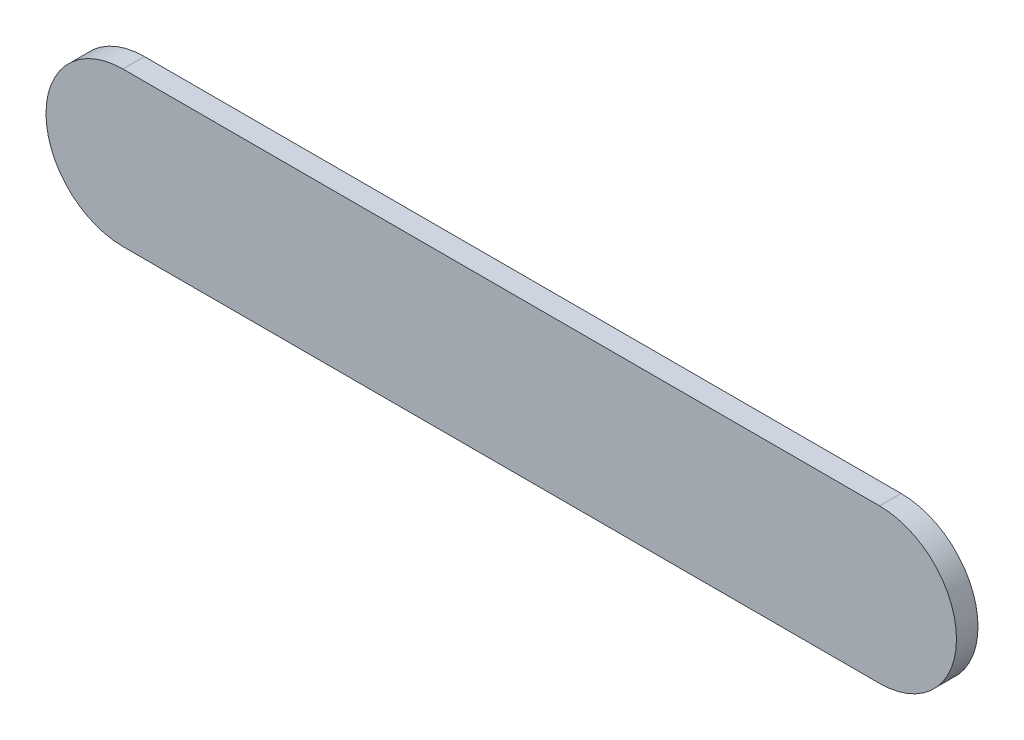
ISO-10303-21;
HEADER;
FILE_DESCRIPTION(('STEP AP214'),'2;1');
FILE_NAME('part.step','',(''),(''),'','','');
FILE_SCHEMA(('AUTOMOTIVE_DESIGN { 1 0 10303 214 1 1 1 1 }'));
ENDSEC;
DATA;
#1=APPLICATION_CONTEXT('core data for automotive mechanical design processes');
#2=APPLICATION_PROTOCOL_DEFINITION('international standard','automotive_design',2000,#1);
#3=PRODUCT_CONTEXT('',#1,'mechanical');
#4=PRODUCT('Part','Part','',(#3));
#5=PRODUCT_RELATED_PRODUCT_CATEGORY('part','',(#4));
#6=PRODUCT_DEFINITION_FORMATION('','',#4);
#7=PRODUCT_DEFINITION_CONTEXT('part definition',#1,'design');
#8=PRODUCT_DEFINITION('design','',#6,#7);
#9=PRODUCT_DEFINITION_SHAPE('','',#8);
#10=(LENGTH_UNIT() NAMED_UNIT(*) SI_UNIT(.MILLI.,.METRE.));
#11=(NAMED_UNIT(*) PLANE_ANGLE_UNIT() SI_UNIT($,.RADIAN.));
#12=(NAMED_UNIT(*) SI_UNIT($,.STERADIAN.) SOLID_ANGLE_UNIT());
#13=UNCERTAINTY_MEASURE_WITH_UNIT(LENGTH_MEASURE(1.E-05),#10,'distance_accuracy_value','');
#14=(GEOMETRIC_REPRESENTATION_CONTEXT(3) GLOBAL_UNCERTAINTY_ASSIGNED_CONTEXT((#13)) GLOBAL_UNIT_ASSIGNED_CONTEXT((#10,
#11,#12)) REPRESENTATION_CONTEXT('',''));
#15=CARTESIAN_POINT('',(0.,0.,0.));
#16=DIRECTION('',(0.,0.,1.));
#17=DIRECTION('',(1.,0.,0.));
#18=AXIS2_PLACEMENT_3D('',#15,#16,#17);
#19=CARTESIAN_POINT('',(87.04199,75.4510048,0.));
#20=DIRECTION('',(0.,1.,0.));
#21=DIRECTION('',(1.,0.,0.));
#22=AXIS2_PLACEMENT_3D('',#19,#20,#21);
#23=PLANE('',#22);
#24=DIRECTION('',(1.,0.,0.));
#25=VECTOR('',#24,1.);
#26=CARTESIAN_POINT('',(87.04199,75.4510048,0.03556));
#27=LINE('',#26,#25);
#28=CARTESIAN_POINT('',(87.04199,75.4510048,0.03556));
#29=VERTEX_POINT('',#28);
#30=CARTESIAN_POINT('',(88.2919748,75.4510048,0.03556));
#31=VERTEX_POINT('',#30);
#32=EDGE_CURVE('E11',#29,#31,#27,.T.);
#33=ORIENTED_EDGE('',*,*,#32,.F.);
#34=DIRECTION('',(0.,0.,1.));
#35=VECTOR('',#34,1.);
#36=CARTESIAN_POINT('',(87.04199,75.4510048,0.));
#37=LINE('',#36,#35);
#38=CARTESIAN_POINT('',(87.04199,75.4510048,0.));
#39=VERTEX_POINT('',#38);
#40=EDGE_CURVE('E24',#39,#29,#37,.T.);
#41=ORIENTED_EDGE('',*,*,#40,.F.);
#42=DIRECTION('',(1.,0.,0.));
#43=VECTOR('',#42,1.);
#44=CARTESIAN_POINT('',(87.04199,75.4510048,0.));
#45=LINE('',#44,#43);
#46=CARTESIAN_POINT('',(88.2919748,75.4510048,0.));
#47=VERTEX_POINT('',#46);
#48=EDGE_CURVE('E75',#39,#47,#45,.T.);
#49=ORIENTED_EDGE('',*,*,#48,.T.);
#50=DIRECTION('',(0.,0.,1.));
#51=VECTOR('',#50,1.);
#52=CARTESIAN_POINT('',(88.2919748,75.4510048,0.));
#53=LINE('',#52,#51);
#54=EDGE_CURVE('E37',#47,#31,#53,.T.);
#55=ORIENTED_EDGE('',*,*,#54,.T.);
#56=EDGE_LOOP('',(#33,#41,#49,#55));
#57=FACE_BOUND('',#56,.T.);
#58=ADVANCED_FACE('F17',(#57),#23,.F.);
#59=CARTESIAN_POINT('',(88.2919748,75.5780048,0.));
#60=DIRECTION('',(0.,0.,-1.));
#61=DIRECTION('',(1.1189649382048E-13,-1.,0.));
#62=AXIS2_PLACEMENT_3D('',#59,#60,#61);
#63=CYLINDRICAL_SURFACE('',#62,0.127000000000005);
#64=CARTESIAN_POINT('',(88.2919748,75.5780048,0.03556));
#65=DIRECTION('',(0.,0.,1.));
#66=DIRECTION('',(1.1189649382048E-13,-1.,0.));
#67=AXIS2_PLACEMENT_3D('',#64,#65,#66);
#68=CIRCLE('',#67,0.127000000000005);
#69=CARTESIAN_POINT('',(88.2919748,75.7050048,0.03556));
#70=VERTEX_POINT('',#69);
#71=EDGE_CURVE('E83',#31,#70,#68,.T.);
#72=ORIENTED_EDGE('',*,*,#71,.F.);
#73=ORIENTED_EDGE('',*,*,#54,.F.);
#74=CARTESIAN_POINT('',(88.2919748,75.5780048,0.));
#75=DIRECTION('',(0.,0.,1.));
#76=DIRECTION('',(1.1189649382048E-13,-1.,0.));
#77=AXIS2_PLACEMENT_3D('',#74,#75,#76);
#78=CIRCLE('',#77,0.127000000000005);
#79=CARTESIAN_POINT('',(88.2919748,75.7050048,0.));
#80=VERTEX_POINT('',#79);
#81=EDGE_CURVE('E81',#47,#80,#78,.T.);
#82=ORIENTED_EDGE('',*,*,#81,.T.);
#83=DIRECTION('',(0.,0.,1.));
#84=VECTOR('',#83,1.);
#85=CARTESIAN_POINT('',(88.2919748,75.7050048,0.));
#86=LINE('',#85,#84);
#87=EDGE_CURVE('E67',#80,#70,#86,.T.);
#88=ORIENTED_EDGE('',*,*,#87,.T.);
#89=EDGE_LOOP('',(#72,#73,#82,#88));
#90=FACE_BOUND('',#89,.T.);
#91=ADVANCED_FACE('F89',(#90),#63,.T.);
#92=CARTESIAN_POINT('',(88.2919748,75.7050048,0.));
#93=DIRECTION('',(0.,-1.,0.));
#94=DIRECTION('',(-1.,0.,0.));
#95=AXIS2_PLACEMENT_3D('',#92,#93,#94);
#96=PLANE('',#95);
#97=DIRECTION('',(-1.,0.,0.));
#98=VECTOR('',#97,1.);
#99=CARTESIAN_POINT('',(88.2919748,75.7050048,0.03556));
#100=LINE('',#99,#98);
#101=CARTESIAN_POINT('',(87.04199,75.7050048,0.03556));
#102=VERTEX_POINT('',#101);
#103=EDGE_CURVE('E71',#70,#102,#100,.T.);
#104=ORIENTED_EDGE('',*,*,#103,.F.);
#105=ORIENTED_EDGE('',*,*,#87,.F.);
#106=DIRECTION('',(-1.,0.,0.));
#107=VECTOR('',#106,1.);
#108=CARTESIAN_POINT('',(88.2919748,75.7050048,0.));
#109=LINE('',#108,#107);
#110=CARTESIAN_POINT('',(87.04199,75.7050048,0.));
#111=VERTEX_POINT('',#110);
#112=EDGE_CURVE('E63',#80,#111,#109,.T.);
#113=ORIENTED_EDGE('',*,*,#112,.T.);
#114=DIRECTION('',(0.,0.,1.));
#115=VECTOR('',#114,1.);
#116=CARTESIAN_POINT('',(87.04199,75.7050048,0.));
#117=LINE('',#116,#115);
#118=EDGE_CURVE('E53',#111,#102,#117,.T.);
#119=ORIENTED_EDGE('',*,*,#118,.T.);
#120=EDGE_LOOP('',(#104,#105,#113,#119));
#121=FACE_BOUND('',#120,.T.);
#122=ADVANCED_FACE('F66',(#121),#96,.F.);
#123=CARTESIAN_POINT('',(87.04199,75.5780048,0.));
#124=DIRECTION('',(0.,0.,-1.));
#125=DIRECTION('',(-1.11896493820492E-13,1.,0.));
#126=AXIS2_PLACEMENT_3D('',#123,#124,#125);
#127=CYLINDRICAL_SURFACE('',#126,0.127000000000005);
#128=CARTESIAN_POINT('',(87.04199,75.5780048,0.03556));
#129=DIRECTION('',(0.,0.,1.));
#130=DIRECTION('',(-1.11896493820492E-13,1.,0.));
#131=AXIS2_PLACEMENT_3D('',#128,#129,#130);
#132=CIRCLE('',#131,0.127000000000005);
#133=EDGE_CURVE('E59',#102,#29,#132,.T.);
#134=ORIENTED_EDGE('',*,*,#133,.F.);
#135=ORIENTED_EDGE('',*,*,#118,.F.);
#136=CARTESIAN_POINT('',(87.04199,75.5780048,0.));
#137=DIRECTION('',(0.,0.,1.));
#138=DIRECTION('',(-1.11896493820492E-13,1.,0.));
#139=AXIS2_PLACEMENT_3D('',#136,#137,#138);
#140=CIRCLE('',#139,0.127000000000005);
#141=EDGE_CURVE('E57',#111,#39,#140,.T.);
#142=ORIENTED_EDGE('',*,*,#141,.T.);
#143=ORIENTED_EDGE('',*,*,#40,.T.);
#144=EDGE_LOOP('',(#134,#135,#142,#143));
#145=FACE_BOUND('',#144,.T.);
#146=ADVANCED_FACE('F55',(#145),#127,.T.);
#147=CARTESIAN_POINT('',(87.04199,75.4510048,0.));
#148=DIRECTION('',(0.,0.,-1.));
#149=DIRECTION('',(-1.,0.,0.));
#150=AXIS2_PLACEMENT_3D('',#147,#148,#149);
#151=PLANE('',#150);
#152=ORIENTED_EDGE('',*,*,#141,.F.);
#153=ORIENTED_EDGE('',*,*,#112,.F.);
#154=ORIENTED_EDGE('',*,*,#81,.F.);
#155=ORIENTED_EDGE('',*,*,#48,.F.);
#156=EDGE_LOOP('',(#152,#153,#154,#155));
#157=FACE_BOUND('',#156,.T.);
#158=ADVANCED_FACE('F74',(#157),#151,.T.);
#159=CARTESIAN_POINT('',(87.04199,75.4510048,0.03556));
#160=DIRECTION('',(0.,0.,-1.));
#161=DIRECTION('',(-1.,0.,0.));
#162=AXIS2_PLACEMENT_3D('',#159,#160,#161);
#163=PLANE('',#162);
#164=ORIENTED_EDGE('',*,*,#32,.T.);
#165=ORIENTED_EDGE('',*,*,#71,.T.);
#166=ORIENTED_EDGE('',*,*,#103,.T.);
#167=ORIENTED_EDGE('',*,*,#133,.T.);
#168=EDGE_LOOP('',(#164,#165,#166,#167));
#169=FACE_BOUND('',#168,.T.);
#170=ADVANCED_FACE('F91',(#169),#163,.F.);
#171=CLOSED_SHELL('',(#58,#91,#122,#146,#158,#170));
#172=MANIFOLD_SOLID_BREP('B1',#171);
#173=ADVANCED_BREP_SHAPE_REPRESENTATION('',(#18,#172),#14);
#174=SHAPE_DEFINITION_REPRESENTATION(#9,#173);
ENDSEC;
END-ISO-10303-21;
